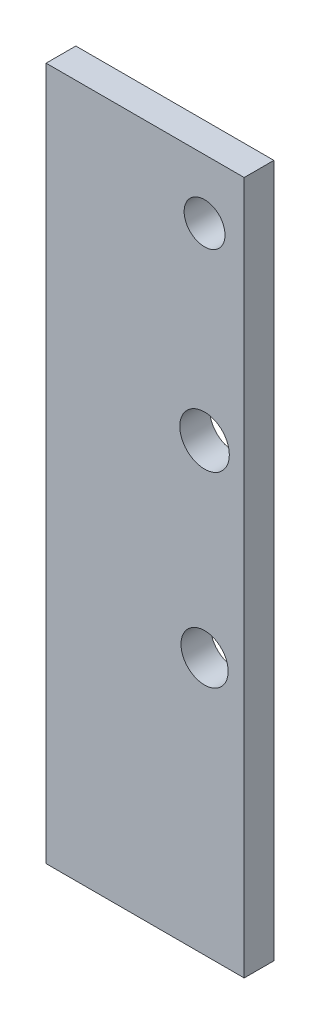
ISO-10303-21;
HEADER;
FILE_DESCRIPTION(('STEP AP214'),'2;1');
FILE_NAME('part.step','',(''),(''),'','','');
FILE_SCHEMA(('AUTOMOTIVE_DESIGN { 1 0 10303 214 1 1 1 1 }'));
ENDSEC;
DATA;
#1=APPLICATION_CONTEXT('core data for automotive mechanical design processes');
#2=APPLICATION_PROTOCOL_DEFINITION('international standard','automotive_design',2000,#1);
#3=PRODUCT_CONTEXT('',#1,'mechanical');
#4=PRODUCT('Part','Part','',(#3));
#5=PRODUCT_RELATED_PRODUCT_CATEGORY('part','',(#4));
#6=PRODUCT_DEFINITION_FORMATION('','',#4);
#7=PRODUCT_DEFINITION_CONTEXT('part definition',#1,'design');
#8=PRODUCT_DEFINITION('design','',#6,#7);
#9=PRODUCT_DEFINITION_SHAPE('','',#8);
#10=(LENGTH_UNIT() NAMED_UNIT(*) SI_UNIT(.MILLI.,.METRE.));
#11=(NAMED_UNIT(*) PLANE_ANGLE_UNIT() SI_UNIT($,.RADIAN.));
#12=(NAMED_UNIT(*) SI_UNIT($,.STERADIAN.) SOLID_ANGLE_UNIT());
#13=UNCERTAINTY_MEASURE_WITH_UNIT(LENGTH_MEASURE(1.E-05),#10,'distance_accuracy_value','');
#14=(GEOMETRIC_REPRESENTATION_CONTEXT(3) GLOBAL_UNCERTAINTY_ASSIGNED_CONTEXT((#13)) GLOBAL_UNIT_ASSIGNED_CONTEXT((#10,
#11,#12)) REPRESENTATION_CONTEXT('',''));
#15=CARTESIAN_POINT('',(0.,0.,0.));
#16=DIRECTION('',(0.,0.,1.));
#17=DIRECTION('',(1.,0.,0.));
#18=AXIS2_PLACEMENT_3D('',#15,#16,#17);
#19=CARTESIAN_POINT('',(0.,350.,0.));
#20=DIRECTION('',(1.,0.,0.));
#21=DIRECTION('',(0.,0.,-1.));
#22=AXIS2_PLACEMENT_3D('',#19,#20,#21);
#23=PLANE('',#22);
#24=DIRECTION('',(0.,0.,1.));
#25=VECTOR('',#24,1.);
#26=CARTESIAN_POINT('',(0.,0.,0.));
#27=LINE('',#26,#25);
#28=CARTESIAN_POINT('',(0.,0.,-15.));
#29=VERTEX_POINT('',#28);
#30=CARTESIAN_POINT('',(0.,0.,0.));
#31=VERTEX_POINT('',#30);
#32=EDGE_CURVE('E107',#29,#31,#27,.T.);
#33=ORIENTED_EDGE('',*,*,#32,.T.);
#34=DIRECTION('',(0.,-1.,0.));
#35=VECTOR('',#34,1.);
#36=CARTESIAN_POINT('',(0.,350.,0.));
#37=LINE('',#36,#35);
#38=CARTESIAN_POINT('',(0.,350.,0.));
#39=VERTEX_POINT('',#38);
#40=EDGE_CURVE('E11',#39,#31,#37,.T.);
#41=ORIENTED_EDGE('',*,*,#40,.F.);
#42=DIRECTION('',(0.,0.,1.));
#43=VECTOR('',#42,1.);
#44=CARTESIAN_POINT('',(0.,350.,0.));
#45=LINE('',#44,#43);
#46=CARTESIAN_POINT('',(0.,350.,-15.));
#47=VERTEX_POINT('',#46);
#48=EDGE_CURVE('E91',#47,#39,#45,.T.);
#49=ORIENTED_EDGE('',*,*,#48,.F.);
#50=DIRECTION('',(0.,-1.,0.));
#51=VECTOR('',#50,1.);
#52=CARTESIAN_POINT('',(0.,350.,-15.));
#53=LINE('',#52,#51);
#54=EDGE_CURVE('E103',#47,#29,#53,.T.);
#55=ORIENTED_EDGE('',*,*,#54,.T.);
#56=EDGE_LOOP('',(#33,#41,#49,#55));
#57=FACE_BOUND('',#56,.T.);
#58=ADVANCED_FACE('F39',(#57),#23,.F.);
#59=CARTESIAN_POINT('',(0.,350.,0.));
#60=DIRECTION('',(0.,0.,-1.));
#61=DIRECTION('',(-1.,0.,0.));
#62=AXIS2_PLACEMENT_3D('',#59,#60,#61);
#63=PLANE('',#62);
#64=CARTESIAN_POINT('',(80.,320.,0.));
#65=DIRECTION('',(0.,0.,1.));
#66=DIRECTION('',(1.,0.,0.));
#67=AXIS2_PLACEMENT_3D('',#64,#65,#66);
#68=CIRCLE('',#67,10.3184522006118);
#69=CARTESIAN_POINT('',(90.3184522006118,320.,0.));
#70=VERTEX_POINT('',#69);
#71=EDGE_CURVE('E144',#70,#70,#68,.T.);
#72=ORIENTED_EDGE('',*,*,#71,.F.);
#73=EDGE_LOOP('',(#72));
#74=FACE_BOUND('',#73,.T.);
#75=CARTESIAN_POINT('',(80.,130.,0.));
#76=DIRECTION('',(0.,0.,1.));
#77=DIRECTION('',(1.,0.,0.));
#78=AXIS2_PLACEMENT_3D('',#75,#76,#77);
#79=CIRCLE('',#78,11.9071489968299);
#80=CARTESIAN_POINT('',(91.9071489968299,130.,0.));
#81=VERTEX_POINT('',#80);
#82=EDGE_CURVE('E136',#81,#81,#79,.T.);
#83=ORIENTED_EDGE('',*,*,#82,.F.);
#84=EDGE_LOOP('',(#83));
#85=FACE_BOUND('',#84,.T.);
#86=CARTESIAN_POINT('',(80.,225.,0.));
#87=DIRECTION('',(0.,0.,1.));
#88=DIRECTION('',(1.,0.,0.));
#89=AXIS2_PLACEMENT_3D('',#86,#87,#88);
#90=CIRCLE('',#89,12.5);
#91=CARTESIAN_POINT('',(92.5,225.,0.));
#92=VERTEX_POINT('',#91);
#93=EDGE_CURVE('E128',#92,#92,#90,.T.);
#94=ORIENTED_EDGE('',*,*,#93,.F.);
#95=EDGE_LOOP('',(#94));
#96=FACE_BOUND('',#95,.T.);
#97=DIRECTION('',(1.,0.,0.));
#98=VECTOR('',#97,1.);
#99=CARTESIAN_POINT('',(0.,0.,0.));
#100=LINE('',#99,#98);
#101=CARTESIAN_POINT('',(100.,0.,0.));
#102=VERTEX_POINT('',#101);
#103=EDGE_CURVE('E96',#31,#102,#100,.T.);
#104=ORIENTED_EDGE('',*,*,#103,.T.);
#105=DIRECTION('',(0.,-1.,0.));
#106=VECTOR('',#105,1.);
#107=CARTESIAN_POINT('',(100.,350.,0.));
#108=LINE('',#107,#106);
#109=CARTESIAN_POINT('',(100.,350.,0.));
#110=VERTEX_POINT('',#109);
#111=EDGE_CURVE('E48',#110,#102,#108,.T.);
#112=ORIENTED_EDGE('',*,*,#111,.F.);
#113=DIRECTION('',(1.,0.,0.));
#114=VECTOR('',#113,1.);
#115=CARTESIAN_POINT('',(0.,350.,0.));
#116=LINE('',#115,#114);
#117=EDGE_CURVE('E86',#39,#110,#116,.T.);
#118=ORIENTED_EDGE('',*,*,#117,.F.);
#119=ORIENTED_EDGE('',*,*,#40,.T.);
#120=EDGE_LOOP('',(#104,#112,#118,#119));
#121=FACE_BOUND('',#120,.T.);
#122=ADVANCED_FACE('F95',(#74,#85,#96,#121),#63,.F.);
#123=CARTESIAN_POINT('',(100.,350.,0.));
#124=DIRECTION('',(-1.,0.,0.));
#125=DIRECTION('',(0.,0.,1.));
#126=AXIS2_PLACEMENT_3D('',#123,#124,#125);
#127=PLANE('',#126);
#128=DIRECTION('',(0.,0.,-1.));
#129=VECTOR('',#128,1.);
#130=CARTESIAN_POINT('',(100.,0.,0.));
#131=LINE('',#130,#129);
#132=CARTESIAN_POINT('',(100.,0.,-15.));
#133=VERTEX_POINT('',#132);
#134=EDGE_CURVE('E73',#102,#133,#131,.T.);
#135=ORIENTED_EDGE('',*,*,#134,.T.);
#136=DIRECTION('',(0.,-1.,0.));
#137=VECTOR('',#136,1.);
#138=CARTESIAN_POINT('',(100.,350.,-15.));
#139=LINE('',#138,#137);
#140=CARTESIAN_POINT('',(100.,350.,-15.));
#141=VERTEX_POINT('',#140);
#142=EDGE_CURVE('E98',#141,#133,#139,.T.);
#143=ORIENTED_EDGE('',*,*,#142,.F.);
#144=DIRECTION('',(0.,0.,-1.));
#145=VECTOR('',#144,1.);
#146=CARTESIAN_POINT('',(100.,350.,0.));
#147=LINE('',#146,#145);
#148=EDGE_CURVE('E89',#110,#141,#147,.T.);
#149=ORIENTED_EDGE('',*,*,#148,.F.);
#150=ORIENTED_EDGE('',*,*,#111,.T.);
#151=EDGE_LOOP('',(#135,#143,#149,#150));
#152=FACE_BOUND('',#151,.T.);
#153=ADVANCED_FACE('F99',(#152),#127,.F.);
#154=CARTESIAN_POINT('',(0.,350.,-15.));
#155=DIRECTION('',(0.,0.,1.));
#156=DIRECTION('',(1.,0.,0.));
#157=AXIS2_PLACEMENT_3D('',#154,#155,#156);
#158=PLANE('',#157);
#159=CARTESIAN_POINT('',(80.,320.,-15.));
#160=DIRECTION('',(0.,0.,1.));
#161=DIRECTION('',(1.,0.,0.));
#162=AXIS2_PLACEMENT_3D('',#159,#160,#161);
#163=CIRCLE('',#162,10.3184522006118);
#164=CARTESIAN_POINT('',(90.3184522006118,320.,-15.));
#165=VERTEX_POINT('',#164);
#166=EDGE_CURVE('E132',#165,#165,#163,.T.);
#167=ORIENTED_EDGE('',*,*,#166,.T.);
#168=EDGE_LOOP('',(#167));
#169=FACE_BOUND('',#168,.T.);
#170=CARTESIAN_POINT('',(80.,130.,-15.));
#171=DIRECTION('',(0.,0.,1.));
#172=DIRECTION('',(1.,0.,0.));
#173=AXIS2_PLACEMENT_3D('',#170,#171,#172);
#174=CIRCLE('',#173,11.9071489968299);
#175=CARTESIAN_POINT('',(91.9071489968299,130.,-15.));
#176=VERTEX_POINT('',#175);
#177=EDGE_CURVE('E140',#176,#176,#174,.T.);
#178=ORIENTED_EDGE('',*,*,#177,.T.);
#179=EDGE_LOOP('',(#178));
#180=FACE_BOUND('',#179,.T.);
#181=CARTESIAN_POINT('',(80.,225.,-15.));
#182=DIRECTION('',(0.,0.,1.));
#183=DIRECTION('',(1.,0.,0.));
#184=AXIS2_PLACEMENT_3D('',#181,#182,#183);
#185=CIRCLE('',#184,12.5);
#186=CARTESIAN_POINT('',(92.5,225.,-15.));
#187=VERTEX_POINT('',#186);
#188=EDGE_CURVE('E111',#187,#187,#185,.T.);
#189=ORIENTED_EDGE('',*,*,#188,.T.);
#190=EDGE_LOOP('',(#189));
#191=FACE_BOUND('',#190,.T.);
#192=DIRECTION('',(-1.,0.,0.));
#193=VECTOR('',#192,1.);
#194=CARTESIAN_POINT('',(0.,0.,-15.));
#195=LINE('',#194,#193);
#196=EDGE_CURVE('E79',#133,#29,#195,.T.);
#197=ORIENTED_EDGE('',*,*,#196,.T.);
#198=ORIENTED_EDGE('',*,*,#54,.F.);
#199=DIRECTION('',(-1.,0.,0.));
#200=VECTOR('',#199,1.);
#201=CARTESIAN_POINT('',(0.,350.,-15.));
#202=LINE('',#201,#200);
#203=EDGE_CURVE('E56',#141,#47,#202,.T.);
#204=ORIENTED_EDGE('',*,*,#203,.F.);
#205=ORIENTED_EDGE('',*,*,#142,.T.);
#206=EDGE_LOOP('',(#197,#198,#204,#205));
#207=FACE_BOUND('',#206,.T.);
#208=ADVANCED_FACE('F121',(#169,#180,#191,#207),#158,.F.);
#209=CARTESIAN_POINT('',(0.,350.,0.));
#210=DIRECTION('',(0.,-1.,0.));
#211=DIRECTION('',(0.,0.,-1.));
#212=AXIS2_PLACEMENT_3D('',#209,#210,#211);
#213=PLANE('',#212);
#214=ORIENTED_EDGE('',*,*,#48,.T.);
#215=ORIENTED_EDGE('',*,*,#117,.T.);
#216=ORIENTED_EDGE('',*,*,#148,.T.);
#217=ORIENTED_EDGE('',*,*,#203,.T.);
#218=EDGE_LOOP('',(#214,#215,#216,#217));
#219=FACE_BOUND('',#218,.T.);
#220=ADVANCED_FACE('F87',(#219),#213,.F.);
#221=CARTESIAN_POINT('',(0.,0.,0.));
#222=DIRECTION('',(0.,-1.,0.));
#223=DIRECTION('',(0.,0.,-1.));
#224=AXIS2_PLACEMENT_3D('',#221,#222,#223);
#225=PLANE('',#224);
#226=ORIENTED_EDGE('',*,*,#32,.F.);
#227=ORIENTED_EDGE('',*,*,#196,.F.);
#228=ORIENTED_EDGE('',*,*,#134,.F.);
#229=ORIENTED_EDGE('',*,*,#103,.F.);
#230=EDGE_LOOP('',(#226,#227,#228,#229));
#231=FACE_BOUND('',#230,.T.);
#232=ADVANCED_FACE('F124',(#231),#225,.T.);
#233=CARTESIAN_POINT('',(80.,225.,-15.));
#234=DIRECTION('',(0.,0.,1.));
#235=DIRECTION('',(1.,0.,0.));
#236=AXIS2_PLACEMENT_3D('',#233,#234,#235);
#237=CYLINDRICAL_SURFACE('',#236,12.5);
#238=ORIENTED_EDGE('',*,*,#188,.F.);
#239=EDGE_LOOP('',(#238));
#240=FACE_BOUND('',#239,.T.);
#241=ORIENTED_EDGE('',*,*,#93,.T.);
#242=EDGE_LOOP('',(#241));
#243=FACE_BOUND('',#242,.T.);
#244=ADVANCED_FACE('F167',(#240,#243),#237,.F.);
#245=CARTESIAN_POINT('',(80.,130.,-15.));
#246=DIRECTION('',(0.,0.,1.));
#247=DIRECTION('',(1.,0.,0.));
#248=AXIS2_PLACEMENT_3D('',#245,#246,#247);
#249=CYLINDRICAL_SURFACE('',#248,11.9071489968299);
#250=ORIENTED_EDGE('',*,*,#177,.F.);
#251=EDGE_LOOP('',(#250));
#252=FACE_BOUND('',#251,.T.);
#253=ORIENTED_EDGE('',*,*,#82,.T.);
#254=EDGE_LOOP('',(#253));
#255=FACE_BOUND('',#254,.T.);
#256=ADVANCED_FACE('F157',(#252,#255),#249,.F.);
#257=CARTESIAN_POINT('',(80.,320.,-15.));
#258=DIRECTION('',(0.,0.,1.));
#259=DIRECTION('',(1.,0.,0.));
#260=AXIS2_PLACEMENT_3D('',#257,#258,#259);
#261=CYLINDRICAL_SURFACE('',#260,10.3184522006118);
#262=ORIENTED_EDGE('',*,*,#166,.F.);
#263=EDGE_LOOP('',(#262));
#264=FACE_BOUND('',#263,.T.);
#265=ORIENTED_EDGE('',*,*,#71,.T.);
#266=EDGE_LOOP('',(#265));
#267=FACE_BOUND('',#266,.T.);
#268=ADVANCED_FACE('F154',(#264,#267),#261,.F.);
#269=CLOSED_SHELL('',(#58,#122,#153,#208,#220,#232,#244,#256,#268));
#270=MANIFOLD_SOLID_BREP('B2',#269);
#271=ADVANCED_BREP_SHAPE_REPRESENTATION('',(#18,#270),#14);
#272=SHAPE_DEFINITION_REPRESENTATION(#9,#271);
ENDSEC;
END-ISO-10303-21;
